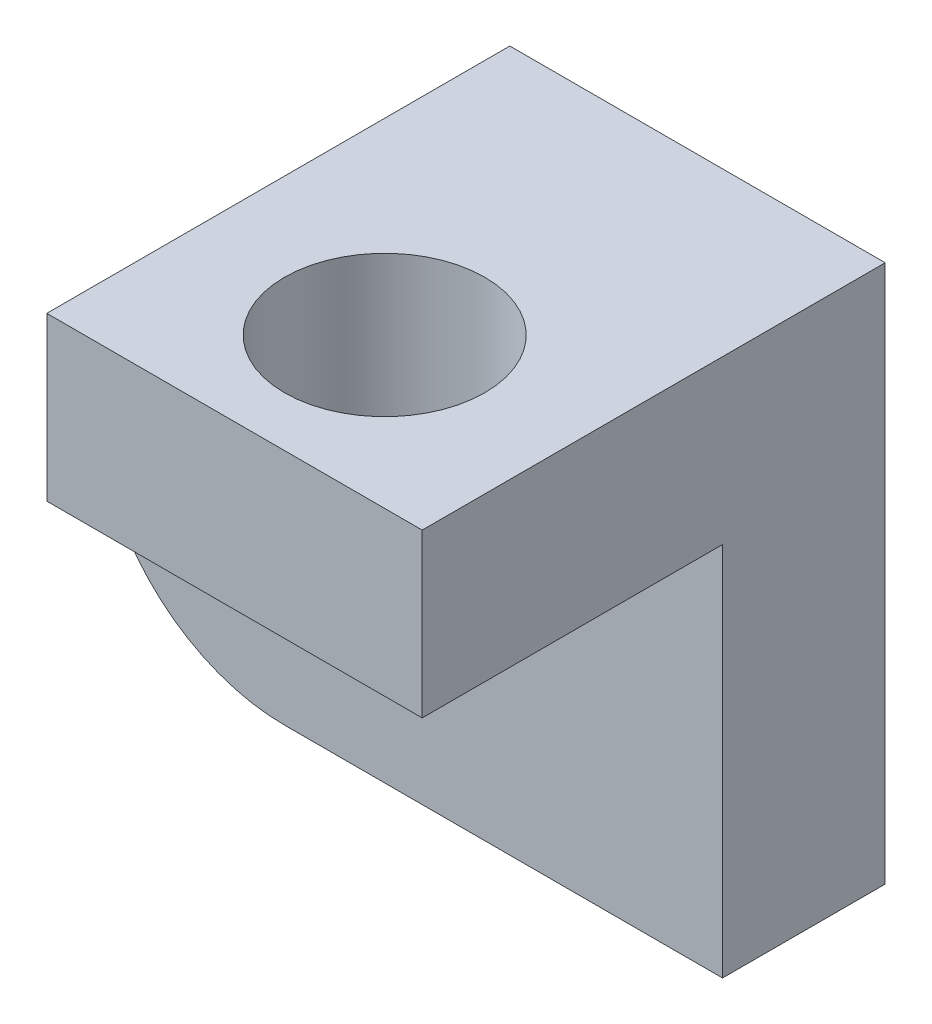
ISO-10303-21;
HEADER;
FILE_DESCRIPTION(('STEP AP214'),'2;1');
FILE_NAME('part.step','',(''),(''),'','','');
FILE_SCHEMA(('AUTOMOTIVE_DESIGN { 1 0 10303 214 1 1 1 1 }'));
ENDSEC;
DATA;
#1=APPLICATION_CONTEXT('core data for automotive mechanical design processes');
#2=APPLICATION_PROTOCOL_DEFINITION('international standard','automotive_design',2000,#1);
#3=PRODUCT_CONTEXT('',#1,'mechanical');
#4=PRODUCT('Part','Part','',(#3));
#5=PRODUCT_RELATED_PRODUCT_CATEGORY('part','',(#4));
#6=PRODUCT_DEFINITION_FORMATION('','',#4);
#7=PRODUCT_DEFINITION_CONTEXT('part definition',#1,'design');
#8=PRODUCT_DEFINITION('design','',#6,#7);
#9=PRODUCT_DEFINITION_SHAPE('','',#8);
#10=(LENGTH_UNIT() NAMED_UNIT(*) SI_UNIT(.MILLI.,.METRE.));
#11=(NAMED_UNIT(*) PLANE_ANGLE_UNIT() SI_UNIT($,.RADIAN.));
#12=(NAMED_UNIT(*) SI_UNIT($,.STERADIAN.) SOLID_ANGLE_UNIT());
#13=UNCERTAINTY_MEASURE_WITH_UNIT(LENGTH_MEASURE(1.E-05),#10,'distance_accuracy_value','');
#14=(GEOMETRIC_REPRESENTATION_CONTEXT(3) GLOBAL_UNCERTAINTY_ASSIGNED_CONTEXT((#13)) GLOBAL_UNIT_ASSIGNED_CONTEXT((#10,
#11,#12)) REPRESENTATION_CONTEXT('',''));
#15=CARTESIAN_POINT('',(0.,0.,0.));
#16=DIRECTION('',(0.,0.,1.));
#17=DIRECTION('',(1.,0.,0.));
#18=AXIS2_PLACEMENT_3D('',#15,#16,#17);
#19=CARTESIAN_POINT('',(-54.3261390952528,30.0000000000001,13.));
#20=DIRECTION('',(0.,-1.,0.));
#21=DIRECTION('',(1.,0.,0.));
#22=AXIS2_PLACEMENT_3D('',#19,#20,#21);
#23=PLANE('',#22);
#24=DIRECTION('',(0.,0.,1.));
#25=VECTOR('',#24,1.);
#26=CARTESIAN_POINT('',(-49.3261390952528,30.0000000000001,13.));
#27=LINE('',#26,#25);
#28=CARTESIAN_POINT('',(-49.3261390952528,30.0000000000001,0.));
#29=VERTEX_POINT('',#28);
#30=CARTESIAN_POINT('',(-49.3261390952528,30.0000000000001,13.));
#31=VERTEX_POINT('',#30);
#32=EDGE_CURVE('E138',#29,#31,#27,.T.);
#33=ORIENTED_EDGE('',*,*,#32,.F.);
#34=DIRECTION('',(-1.,0.,0.));
#35=VECTOR('',#34,1.);
#36=CARTESIAN_POINT('',(-54.3261390952528,30.0000000000001,0.));
#37=LINE('',#36,#35);
#38=CARTESIAN_POINT('',(-54.3261390952528,30.0000000000001,0.));
#39=VERTEX_POINT('',#38);
#40=EDGE_CURVE('E83',#29,#39,#37,.T.);
#41=ORIENTED_EDGE('',*,*,#40,.T.);
#42=DIRECTION('',(0.,0.,-1.));
#43=VECTOR('',#42,1.);
#44=CARTESIAN_POINT('',(-54.3261390952528,30.0000000000001,13.));
#45=LINE('',#44,#43);
#46=CARTESIAN_POINT('',(-54.3261390952528,30.0000000000001,13.));
#47=VERTEX_POINT('',#46);
#48=EDGE_CURVE('E179',#47,#39,#45,.T.);
#49=ORIENTED_EDGE('',*,*,#48,.F.);
#50=DIRECTION('',(-1.,0.,0.));
#51=VECTOR('',#50,1.);
#52=CARTESIAN_POINT('',(-54.3261390952528,30.0000000000001,13.));
#53=LINE('',#52,#51);
#54=EDGE_CURVE('E65',#31,#47,#53,.T.);
#55=ORIENTED_EDGE('',*,*,#54,.F.);
#56=EDGE_LOOP('',(#33,#41,#49,#55));
#57=FACE_BOUND('',#56,.T.);
#58=ADVANCED_FACE('F43',(#57),#23,.F.);
#59=CARTESIAN_POINT('',(-54.3261390952528,15.0000000000001,13.));
#60=DIRECTION('',(0.,0.,1.));
#61=DIRECTION('',(1.,0.,0.));
#62=AXIS2_PLACEMENT_3D('',#59,#60,#61);
#63=PLANE('',#62);
#64=DIRECTION('',(1.,0.,0.));
#65=VECTOR('',#64,1.);
#66=CARTESIAN_POINT('',(-49.3261390952528,30.0000000000001,13.));
#67=LINE('',#66,#65);
#68=CARTESIAN_POINT('',(-19.3261390952528,30.0000000000001,13.));
#69=VERTEX_POINT('',#68);
#70=EDGE_CURVE('E59',#31,#69,#67,.T.);
#71=ORIENTED_EDGE('',*,*,#70,.F.);
#72=ORIENTED_EDGE('',*,*,#54,.T.);
#73=CARTESIAN_POINT('',(-54.3261390952528,15.0000000000001,13.));
#74=DIRECTION('',(0.,0.,1.));
#75=DIRECTION('',(1.,0.,0.));
#76=AXIS2_PLACEMENT_3D('',#73,#74,#75);
#77=CIRCLE('',#76,15.);
#78=CARTESIAN_POINT('',(-54.3261390952528,0.,13.));
#79=VERTEX_POINT('',#78);
#80=EDGE_CURVE('E169',#47,#79,#77,.T.);
#81=ORIENTED_EDGE('',*,*,#80,.T.);
#82=DIRECTION('',(1.,0.,0.));
#83=VECTOR('',#82,1.);
#84=CARTESIAN_POINT('',(-54.3261390952528,0.,13.));
#85=LINE('',#84,#83);
#86=CARTESIAN_POINT('',(-19.3261390952528,0.,13.));
#87=VERTEX_POINT('',#86);
#88=EDGE_CURVE('E88',#79,#87,#85,.T.);
#89=ORIENTED_EDGE('',*,*,#88,.T.);
#90=DIRECTION('',(0.,1.,0.));
#91=VECTOR('',#90,1.);
#92=CARTESIAN_POINT('',(-19.3261390952528,0.,13.));
#93=LINE('',#92,#91);
#94=EDGE_CURVE('E174',#87,#69,#93,.T.);
#95=ORIENTED_EDGE('',*,*,#94,.T.);
#96=EDGE_LOOP('',(#71,#72,#81,#89,#95));
#97=FACE_BOUND('',#96,.T.);
#98=CARTESIAN_POINT('',(-54.3261390952528,15.0000000000001,13.));
#99=DIRECTION('',(0.,0.,1.));
#100=DIRECTION('',(1.,0.,0.));
#101=AXIS2_PLACEMENT_3D('',#98,#99,#100);
#102=CIRCLE('',#101,6.5);
#103=CARTESIAN_POINT('',(-47.8261390952528,15.0000000000001,13.));
#104=VERTEX_POINT('',#103);
#105=EDGE_CURVE('E161',#104,#104,#102,.T.);
#106=ORIENTED_EDGE('',*,*,#105,.F.);
#107=EDGE_LOOP('',(#106));
#108=FACE_BOUND('',#107,.T.);
#109=ADVANCED_FACE('F234',(#97,#108),#63,.T.);
#110=CARTESIAN_POINT('',(-54.3261390952528,15.0000000000001,0.));
#111=DIRECTION('',(0.,0.,1.));
#112=DIRECTION('',(1.,0.,0.));
#113=AXIS2_PLACEMENT_3D('',#110,#111,#112);
#114=PLANE('',#113);
#115=CARTESIAN_POINT('',(-54.3261390952528,15.0000000000001,0.));
#116=DIRECTION('',(0.,0.,1.));
#117=DIRECTION('',(1.,0.,0.));
#118=AXIS2_PLACEMENT_3D('',#115,#116,#117);
#119=CIRCLE('',#118,15.);
#120=CARTESIAN_POINT('',(-54.3261390952528,0.,0.));
#121=VERTEX_POINT('',#120);
#122=EDGE_CURVE('E165',#39,#121,#119,.T.);
#123=ORIENTED_EDGE('',*,*,#122,.F.);
#124=ORIENTED_EDGE('',*,*,#40,.F.);
#125=DIRECTION('',(0.,-1.,0.));
#126=VECTOR('',#125,1.);
#127=CARTESIAN_POINT('',(-49.3261390952528,43.0000000000001,0.));
#128=LINE('',#127,#126);
#129=CARTESIAN_POINT('',(-49.3261390952528,43.0000000000001,0.));
#130=VERTEX_POINT('',#129);
#131=EDGE_CURVE('E156',#130,#29,#128,.T.);
#132=ORIENTED_EDGE('',*,*,#131,.F.);
#133=DIRECTION('',(-1.,0.,0.));
#134=VECTOR('',#133,1.);
#135=CARTESIAN_POINT('',(-19.3261390952528,43.0000000000001,0.));
#136=LINE('',#135,#134);
#137=CARTESIAN_POINT('',(-19.3261390952528,43.0000000000001,0.));
#138=VERTEX_POINT('',#137);
#139=EDGE_CURVE('E151',#138,#130,#136,.T.);
#140=ORIENTED_EDGE('',*,*,#139,.F.);
#141=DIRECTION('',(0.,1.,0.));
#142=VECTOR('',#141,1.);
#143=CARTESIAN_POINT('',(-19.3261390952528,0.,0.));
#144=LINE('',#143,#142);
#145=CARTESIAN_POINT('',(-19.3261390952528,0.,0.));
#146=VERTEX_POINT('',#145);
#147=EDGE_CURVE('E186',#146,#138,#144,.T.);
#148=ORIENTED_EDGE('',*,*,#147,.F.);
#149=DIRECTION('',(1.,0.,0.));
#150=VECTOR('',#149,1.);
#151=CARTESIAN_POINT('',(-54.3261390952528,0.,0.));
#152=LINE('',#151,#150);
#153=EDGE_CURVE('E183',#121,#146,#152,.T.);
#154=ORIENTED_EDGE('',*,*,#153,.F.);
#155=EDGE_LOOP('',(#123,#124,#132,#140,#148,#154));
#156=FACE_BOUND('',#155,.T.);
#157=CARTESIAN_POINT('',(-54.3261390952528,15.0000000000001,0.));
#158=DIRECTION('',(0.,0.,1.));
#159=DIRECTION('',(1.,0.,0.));
#160=AXIS2_PLACEMENT_3D('',#157,#158,#159);
#161=CIRCLE('',#160,6.5);
#162=CARTESIAN_POINT('',(-47.8261390952528,15.0000000000001,0.));
#163=VERTEX_POINT('',#162);
#164=EDGE_CURVE('E160',#163,#163,#161,.T.);
#165=ORIENTED_EDGE('',*,*,#164,.T.);
#166=EDGE_LOOP('',(#165));
#167=FACE_BOUND('',#166,.T.);
#168=ADVANCED_FACE('F201',(#156,#167),#114,.F.);
#169=CARTESIAN_POINT('',(-54.3261390952528,15.0000000000001,13.));
#170=DIRECTION('',(0.,0.,-1.));
#171=DIRECTION('',(-1.,0.,0.));
#172=AXIS2_PLACEMENT_3D('',#169,#170,#171);
#173=CYLINDRICAL_SURFACE('',#172,15.);
#174=ORIENTED_EDGE('',*,*,#122,.T.);
#175=DIRECTION('',(0.,0.,-1.));
#176=VECTOR('',#175,1.);
#177=CARTESIAN_POINT('',(-54.3261390952528,0.,13.));
#178=LINE('',#177,#176);
#179=EDGE_CURVE('E11',#79,#121,#178,.T.);
#180=ORIENTED_EDGE('',*,*,#179,.F.);
#181=ORIENTED_EDGE('',*,*,#80,.F.);
#182=ORIENTED_EDGE('',*,*,#48,.T.);
#183=EDGE_LOOP('',(#174,#180,#181,#182));
#184=FACE_BOUND('',#183,.T.);
#185=ADVANCED_FACE('F45',(#184),#173,.T.);
#186=CARTESIAN_POINT('',(-54.3261390952528,0.,13.));
#187=DIRECTION('',(0.,1.,0.));
#188=DIRECTION('',(-1.,0.,0.));
#189=AXIS2_PLACEMENT_3D('',#186,#187,#188);
#190=PLANE('',#189);
#191=ORIENTED_EDGE('',*,*,#153,.T.);
#192=DIRECTION('',(0.,0.,-1.));
#193=VECTOR('',#192,1.);
#194=CARTESIAN_POINT('',(-19.3261390952528,0.,13.));
#195=LINE('',#194,#193);
#196=EDGE_CURVE('E52',#87,#146,#195,.T.);
#197=ORIENTED_EDGE('',*,*,#196,.F.);
#198=ORIENTED_EDGE('',*,*,#88,.F.);
#199=ORIENTED_EDGE('',*,*,#179,.T.);
#200=EDGE_LOOP('',(#191,#197,#198,#199));
#201=FACE_BOUND('',#200,.T.);
#202=ADVANCED_FACE('F244',(#201),#190,.F.);
#203=CARTESIAN_POINT('',(-19.3261390952528,0.,13.));
#204=DIRECTION('',(-1.,0.,0.));
#205=DIRECTION('',(0.,0.,1.));
#206=AXIS2_PLACEMENT_3D('',#203,#204,#205);
#207=PLANE('',#206);
#208=ORIENTED_EDGE('',*,*,#147,.T.);
#209=DIRECTION('',(0.,0.,-1.));
#210=VECTOR('',#209,1.);
#211=CARTESIAN_POINT('',(-19.3261390952528,43.0000000000001,13.));
#212=LINE('',#211,#210);
#213=CARTESIAN_POINT('',(-19.3261390952528,43.0000000000001,37.));
#214=VERTEX_POINT('',#213);
#215=EDGE_CURVE('E143',#214,#138,#212,.T.);
#216=ORIENTED_EDGE('',*,*,#215,.F.);
#217=DIRECTION('',(0.,1.,0.));
#218=VECTOR('',#217,1.);
#219=CARTESIAN_POINT('',(-19.3261390952528,30.0000000000001,37.));
#220=LINE('',#219,#218);
#221=CARTESIAN_POINT('',(-19.3261390952528,30.0000000000001,37.));
#222=VERTEX_POINT('',#221);
#223=EDGE_CURVE('E125',#222,#214,#220,.T.);
#224=ORIENTED_EDGE('',*,*,#223,.F.);
#225=DIRECTION('',(0.,0.,-1.));
#226=VECTOR('',#225,1.);
#227=CARTESIAN_POINT('',(-19.3261390952528,30.0000000000001,37.));
#228=LINE('',#227,#226);
#229=EDGE_CURVE('E120',#222,#69,#228,.T.);
#230=ORIENTED_EDGE('',*,*,#229,.T.);
#231=ORIENTED_EDGE('',*,*,#94,.F.);
#232=ORIENTED_EDGE('',*,*,#196,.T.);
#233=EDGE_LOOP('',(#208,#216,#224,#230,#231,#232));
#234=FACE_BOUND('',#233,.T.);
#235=ADVANCED_FACE('F197',(#234),#207,.F.);
#236=CARTESIAN_POINT('',(-54.3261390952528,15.0000000000001,13.));
#237=DIRECTION('',(0.,0.,-1.));
#238=DIRECTION('',(-1.,0.,0.));
#239=AXIS2_PLACEMENT_3D('',#236,#237,#238);
#240=CYLINDRICAL_SURFACE('',#239,6.5);
#241=ORIENTED_EDGE('',*,*,#105,.T.);
#242=EDGE_LOOP('',(#241));
#243=FACE_BOUND('',#242,.T.);
#244=ORIENTED_EDGE('',*,*,#164,.F.);
#245=EDGE_LOOP('',(#244));
#246=FACE_BOUND('',#245,.T.);
#247=ADVANCED_FACE('F243',(#243,#246),#240,.F.);
#248=CARTESIAN_POINT('',(-49.3261390952528,43.0000000000001,13.));
#249=DIRECTION('',(1.,0.,0.));
#250=DIRECTION('',(0.,1.,0.));
#251=AXIS2_PLACEMENT_3D('',#248,#249,#250);
#252=PLANE('',#251);
#253=ORIENTED_EDGE('',*,*,#32,.T.);
#254=DIRECTION('',(0.,0.,-1.));
#255=VECTOR('',#254,1.);
#256=CARTESIAN_POINT('',(-49.3261390952528,30.0000000000001,37.));
#257=LINE('',#256,#255);
#258=CARTESIAN_POINT('',(-49.3261390952528,30.0000000000001,37.));
#259=VERTEX_POINT('',#258);
#260=EDGE_CURVE('E118',#259,#31,#257,.T.);
#261=ORIENTED_EDGE('',*,*,#260,.F.);
#262=DIRECTION('',(0.,-1.,0.));
#263=VECTOR('',#262,1.);
#264=CARTESIAN_POINT('',(-49.3261390952528,30.0000000000001,37.));
#265=LINE('',#264,#263);
#266=CARTESIAN_POINT('',(-49.3261390952528,43.0000000000001,37.));
#267=VERTEX_POINT('',#266);
#268=EDGE_CURVE('E126',#267,#259,#265,.T.);
#269=ORIENTED_EDGE('',*,*,#268,.F.);
#270=DIRECTION('',(0.,0.,1.));
#271=VECTOR('',#270,1.);
#272=CARTESIAN_POINT('',(-49.3261390952528,43.0000000000001,13.));
#273=LINE('',#272,#271);
#274=EDGE_CURVE('E154',#130,#267,#273,.T.);
#275=ORIENTED_EDGE('',*,*,#274,.F.);
#276=ORIENTED_EDGE('',*,*,#131,.T.);
#277=EDGE_LOOP('',(#253,#261,#269,#275,#276));
#278=FACE_BOUND('',#277,.T.);
#279=ADVANCED_FACE('F137',(#278),#252,.F.);
#280=CARTESIAN_POINT('',(0.,43.0000000000001,0.));
#281=DIRECTION('',(0.,1.,0.));
#282=DIRECTION('',(-1.,0.,0.));
#283=AXIS2_PLACEMENT_3D('',#280,#281,#282);
#284=PLANE('',#283);
#285=CARTESIAN_POINT('',(-34.3261390952528,43.0000000000001,25.));
#286=DIRECTION('',(0.,-1.,0.));
#287=DIRECTION('',(0.,0.,-1.));
#288=AXIS2_PLACEMENT_3D('',#285,#286,#287);
#289=CIRCLE('',#288,8.);
#290=CARTESIAN_POINT('',(-34.3261390952528,43.0000000000001,17.));
#291=VERTEX_POINT('',#290);
#292=EDGE_CURVE('E211',#291,#291,#289,.T.);
#293=ORIENTED_EDGE('',*,*,#292,.T.);
#294=EDGE_LOOP('',(#293));
#295=FACE_BOUND('',#294,.T.);
#296=ORIENTED_EDGE('',*,*,#215,.T.);
#297=ORIENTED_EDGE('',*,*,#139,.T.);
#298=ORIENTED_EDGE('',*,*,#274,.T.);
#299=DIRECTION('',(-1.,0.,0.));
#300=VECTOR('',#299,1.);
#301=CARTESIAN_POINT('',(-49.3261390952528,43.0000000000001,37.));
#302=LINE('',#301,#300);
#303=EDGE_CURVE('E132',#214,#267,#302,.T.);
#304=ORIENTED_EDGE('',*,*,#303,.F.);
#305=EDGE_LOOP('',(#296,#297,#298,#304));
#306=FACE_BOUND('',#305,.T.);
#307=ADVANCED_FACE('F205',(#295,#306),#284,.T.);
#308=CARTESIAN_POINT('',(-49.3261390952528,30.0000000000001,37.));
#309=DIRECTION('',(0.,1.,0.));
#310=DIRECTION('',(0.,0.,1.));
#311=AXIS2_PLACEMENT_3D('',#308,#309,#310);
#312=PLANE('',#311);
#313=CARTESIAN_POINT('',(-34.3261390952528,30.0000000000001,25.));
#314=DIRECTION('',(0.,-1.,0.));
#315=DIRECTION('',(0.,0.,-1.));
#316=AXIS2_PLACEMENT_3D('',#313,#314,#315);
#317=CIRCLE('',#316,8.);
#318=CARTESIAN_POINT('',(-34.3261390952528,30.0000000000001,17.));
#319=VERTEX_POINT('',#318);
#320=EDGE_CURVE('E214',#319,#319,#317,.T.);
#321=ORIENTED_EDGE('',*,*,#320,.F.);
#322=EDGE_LOOP('',(#321));
#323=FACE_BOUND('',#322,.T.);
#324=ORIENTED_EDGE('',*,*,#70,.T.);
#325=ORIENTED_EDGE('',*,*,#229,.F.);
#326=DIRECTION('',(1.,0.,0.));
#327=VECTOR('',#326,1.);
#328=CARTESIAN_POINT('',(-49.3261390952528,30.0000000000001,37.));
#329=LINE('',#328,#327);
#330=EDGE_CURVE('E114',#259,#222,#329,.T.);
#331=ORIENTED_EDGE('',*,*,#330,.F.);
#332=ORIENTED_EDGE('',*,*,#260,.T.);
#333=EDGE_LOOP('',(#324,#325,#331,#332));
#334=FACE_BOUND('',#333,.T.);
#335=ADVANCED_FACE('F116',(#323,#334),#312,.F.);
#336=CARTESIAN_POINT('',(0.,0.,37.));
#337=DIRECTION('',(0.,0.,-1.));
#338=DIRECTION('',(-1.,0.,0.));
#339=AXIS2_PLACEMENT_3D('',#336,#337,#338);
#340=PLANE('',#339);
#341=ORIENTED_EDGE('',*,*,#268,.T.);
#342=ORIENTED_EDGE('',*,*,#330,.T.);
#343=ORIENTED_EDGE('',*,*,#223,.T.);
#344=ORIENTED_EDGE('',*,*,#303,.T.);
#345=EDGE_LOOP('',(#341,#342,#343,#344));
#346=FACE_BOUND('',#345,.T.);
#347=ADVANCED_FACE('F130',(#346),#340,.F.);
#348=CARTESIAN_POINT('',(-34.3261390952528,43.0000000000001,25.));
#349=DIRECTION('',(0.,-1.,0.));
#350=DIRECTION('',(0.,0.,-1.));
#351=AXIS2_PLACEMENT_3D('',#348,#349,#350);
#352=CYLINDRICAL_SURFACE('',#351,8.);
#353=ORIENTED_EDGE('',*,*,#292,.F.);
#354=EDGE_LOOP('',(#353));
#355=FACE_BOUND('',#354,.T.);
#356=ORIENTED_EDGE('',*,*,#320,.T.);
#357=EDGE_LOOP('',(#356));
#358=FACE_BOUND('',#357,.T.);
#359=ADVANCED_FACE('F223',(#355,#358),#352,.F.);
#360=CLOSED_SHELL('',(#58,#109,#168,#185,#202,#235,#247,#279,#307,#335,#347,#359));
#361=MANIFOLD_SOLID_BREP('B2',#360);
#362=ADVANCED_BREP_SHAPE_REPRESENTATION('',(#18,#361),#14);
#363=SHAPE_DEFINITION_REPRESENTATION(#9,#362);
ENDSEC;
END-ISO-10303-21;
